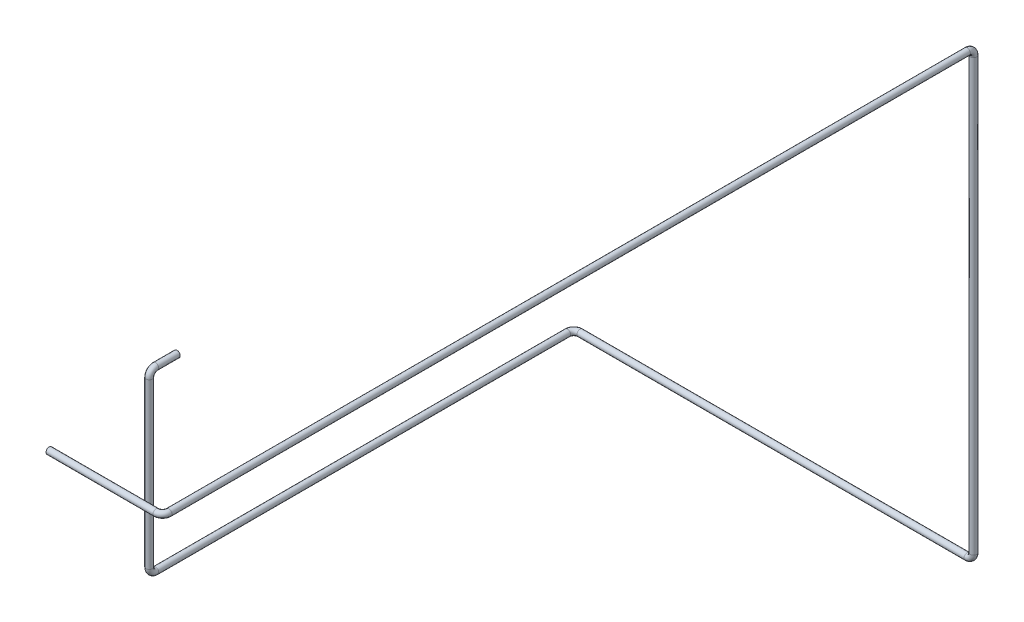
ISO-10303-21;
HEADER;
FILE_DESCRIPTION(('STEP AP214'),'2;1');
FILE_NAME('part.step','',(''),(''),'','','');
FILE_SCHEMA(('AUTOMOTIVE_DESIGN { 1 0 10303 214 1 1 1 1 }'));
ENDSEC;
DATA;
#1=APPLICATION_CONTEXT('core data for automotive mechanical design processes');
#2=APPLICATION_PROTOCOL_DEFINITION('international standard','automotive_design',2000,#1);
#3=PRODUCT_CONTEXT('',#1,'mechanical');
#4=PRODUCT('Part','Part','',(#3));
#5=PRODUCT_RELATED_PRODUCT_CATEGORY('part','',(#4));
#6=PRODUCT_DEFINITION_FORMATION('','',#4);
#7=PRODUCT_DEFINITION_CONTEXT('part definition',#1,'design');
#8=PRODUCT_DEFINITION('design','',#6,#7);
#9=PRODUCT_DEFINITION_SHAPE('','',#8);
#10=(LENGTH_UNIT() NAMED_UNIT(*) SI_UNIT(.MILLI.,.METRE.));
#11=(NAMED_UNIT(*) PLANE_ANGLE_UNIT() SI_UNIT($,.RADIAN.));
#12=(NAMED_UNIT(*) SI_UNIT($,.STERADIAN.) SOLID_ANGLE_UNIT());
#13=UNCERTAINTY_MEASURE_WITH_UNIT(LENGTH_MEASURE(1.E-05),#10,'distance_accuracy_value','');
#14=(GEOMETRIC_REPRESENTATION_CONTEXT(3) GLOBAL_UNCERTAINTY_ASSIGNED_CONTEXT((#13)) GLOBAL_UNIT_ASSIGNED_CONTEXT((#10,
#11,#12)) REPRESENTATION_CONTEXT('',''));
#15=CARTESIAN_POINT('',(0.,0.,0.));
#16=DIRECTION('',(0.,0.,1.));
#17=DIRECTION('',(1.,0.,0.));
#18=AXIS2_PLACEMENT_3D('',#15,#16,#17);
#19=CARTESIAN_POINT('',(-29691.5161722902,-14997.0136339344,42998.3901960568));
#20=DIRECTION('',(1.,0.,0.));
#21=DIRECTION('',(0.,0.,-1.));
#22=AXIS2_PLACEMENT_3D('',#19,#20,#21);
#23=PLANE('',#22);
#24=CARTESIAN_POINT('',(-29691.5161722902,-14997.0136339344,42998.3901960568));
#25=DIRECTION('',(1.,0.,0.));
#26=DIRECTION('',(0.,0.,-1.));
#27=AXIS2_PLACEMENT_3D('',#24,#25,#26);
#28=CIRCLE('',#27,14.0000000000006);
#29=CARTESIAN_POINT('',(-29691.5161722902,-14997.0136339344,42984.3901960568));
#30=VERTEX_POINT('',#29);
#31=EDGE_CURVE('E100',#30,#30,#28,.T.);
#32=ORIENTED_EDGE('',*,*,#31,.T.);
#33=EDGE_LOOP('',(#32));
#34=FACE_BOUND('',#33,.T.);
#35=CARTESIAN_POINT('',(-29691.5161722902,-14997.0136339344,42998.3901960568));
#36=DIRECTION('',(1.,0.,0.));
#37=DIRECTION('',(0.,0.,-1.));
#38=AXIS2_PLACEMENT_3D('',#35,#36,#37);
#39=CIRCLE('',#38,15.0000000000006);
#40=CARTESIAN_POINT('',(-29691.5161722902,-14997.0136339344,42983.3901960568));
#41=VERTEX_POINT('',#40);
#42=EDGE_CURVE('E93',#41,#41,#39,.T.);
#43=ORIENTED_EDGE('',*,*,#42,.F.);
#44=EDGE_LOOP('',(#43));
#45=FACE_BOUND('',#44,.T.);
#46=ADVANCED_FACE('F47',(#34,#45),#23,.F.);
#47=CARTESIAN_POINT('',(-31046.0335157072,-16257.8595062918,41039.2367122807));
#48=DIRECTION('',(0.,0.,-1.));
#49=DIRECTION('',(0.,-1.,0.));
#50=AXIS2_PLACEMENT_3D('',#47,#48,#49);
#51=PLANE('',#50);
#52=CARTESIAN_POINT('',(-31046.0335157072,-16257.8595062918,41039.2367122807));
#53=DIRECTION('',(0.,0.,-1.));
#54=DIRECTION('',(-1.,0.,0.));
#55=AXIS2_PLACEMENT_3D('',#52,#53,#54);
#56=CIRCLE('',#55,14.0000000000006);
#57=CARTESIAN_POINT('',(-31060.0335157072,-16257.8595062918,41039.2367122807));
#58=VERTEX_POINT('',#57);
#59=EDGE_CURVE('E96',#58,#58,#56,.T.);
#60=ORIENTED_EDGE('',*,*,#59,.F.);
#61=EDGE_LOOP('',(#60));
#62=FACE_BOUND('',#61,.T.);
#63=CARTESIAN_POINT('',(-31046.0335157072,-16257.8595062918,41039.2367122807));
#64=DIRECTION('',(0.,0.,-1.));
#65=DIRECTION('',(0.,-1.,0.));
#66=AXIS2_PLACEMENT_3D('',#63,#64,#65);
#67=CIRCLE('',#66,15.0000000000006);
#68=CARTESIAN_POINT('',(-31046.0335157072,-16272.8595062918,41039.2367122807));
#69=VERTEX_POINT('',#68);
#70=EDGE_CURVE('E11',#69,#69,#67,.T.);
#71=ORIENTED_EDGE('',*,*,#70,.T.);
#72=EDGE_LOOP('',(#71));
#73=FACE_BOUND('',#72,.T.);
#74=ADVANCED_FACE('F167',(#62,#73),#51,.T.);
#75=CARTESIAN_POINT('',(-29691.5161722902,-14997.0136339344,42998.3901960568));
#76=DIRECTION('',(1.,0.,0.));
#77=DIRECTION('',(0.,0.,-1.));
#78=AXIS2_PLACEMENT_3D('',#75,#76,#77);
#79=CYLINDRICAL_SURFACE('',#78,15.0000000000006);
#80=CARTESIAN_POINT('',(-29185.3000286654,-14997.0136339344,42998.3901960568));
#81=DIRECTION('',(1.,0.,0.));
#82=DIRECTION('',(0.,0.,-1.));
#83=AXIS2_PLACEMENT_3D('',#80,#81,#82);
#84=CIRCLE('',#83,15.0000000000006);
#85=CARTESIAN_POINT('',(-29185.3000286654,-14997.0136339344,43013.3901960568));
#86=VERTEX_POINT('',#85);
#87=EDGE_CURVE('E90',#86,#86,#84,.T.);
#88=ORIENTED_EDGE('',*,*,#87,.F.);
#89=EDGE_LOOP('',(#88));
#90=FACE_BOUND('',#89,.T.);
#91=ORIENTED_EDGE('',*,*,#42,.T.);
#92=EDGE_LOOP('',(#91));
#93=FACE_BOUND('',#92,.T.);
#94=ADVANCED_FACE('F169',(#90,#93),#79,.T.);
#95=CARTESIAN_POINT('',(-29185.3000286654,-14997.0136339344,42968.3901960568));
#96=DIRECTION('',(0.,1.,0.));
#97=DIRECTION('',(0.,0.,1.));
#98=AXIS2_PLACEMENT_3D('',#95,#96,#97);
#99=TOROIDAL_SURFACE('',#98,30.0000000000011,15.0000000000006);
#100=CARTESIAN_POINT('',(-29155.3000286654,-14997.0136339344,42968.3901960568));
#101=DIRECTION('',(0.,0.,-1.));
#102=DIRECTION('',(-1.,0.,0.));
#103=AXIS2_PLACEMENT_3D('',#100,#101,#102);
#104=CIRCLE('',#103,15.0000000000006);
#105=CARTESIAN_POINT('',(-29140.3000286654,-14997.0136339344,42968.3901960568));
#106=VERTEX_POINT('',#105);
#107=EDGE_CURVE('E87',#106,#106,#104,.T.);
#108=CARTESIAN_POINT('',(-29185.3000286654,-14997.0136339344,42968.3901960568));
#109=DIRECTION('',(0.,1.,0.));
#110=DIRECTION('',(0.,0.,1.));
#111=AXIS2_PLACEMENT_3D('',#108,#109,#110);
#112=CIRCLE('',#111,45.0000000000017);
#113=EDGE_CURVE('',#86,#106,#112,.T.);
#114=ORIENTED_EDGE('',*,*,#87,.T.);
#115=ORIENTED_EDGE('',*,*,#107,.F.);
#116=ORIENTED_EDGE('',*,*,#113,.T.);
#117=ORIENTED_EDGE('',*,*,#113,.F.);
#118=EDGE_LOOP('',(#114,#116,#115,#117));
#119=FACE_BOUND('',#118,.T.);
#120=ADVANCED_FACE('F175',(#119),#99,.T.);
#121=CARTESIAN_POINT('',(-29155.3000286654,-14997.0136339344,42968.3901960568));
#122=DIRECTION('',(0.,0.,-1.));
#123=DIRECTION('',(-1.,0.,0.));
#124=AXIS2_PLACEMENT_3D('',#121,#122,#123);
#125=CYLINDRICAL_SURFACE('',#124,15.0000000000006);
#126=CARTESIAN_POINT('',(-29155.3000286654,-14997.0136339344,39192.6412042976));
#127=DIRECTION('',(0.,0.,-1.));
#128=DIRECTION('',(-1.,0.,0.));
#129=AXIS2_PLACEMENT_3D('',#126,#127,#128);
#130=CIRCLE('',#129,15.0000000000006);
#131=CARTESIAN_POINT('',(-29155.3000286654,-14982.0136339344,39192.6412042976));
#132=VERTEX_POINT('',#131);
#133=EDGE_CURVE('E84',#132,#132,#130,.T.);
#134=ORIENTED_EDGE('',*,*,#133,.F.);
#135=EDGE_LOOP('',(#134));
#136=FACE_BOUND('',#135,.T.);
#137=ORIENTED_EDGE('',*,*,#107,.T.);
#138=EDGE_LOOP('',(#137));
#139=FACE_BOUND('',#138,.T.);
#140=ADVANCED_FACE('F246',(#136,#139),#125,.T.);
#141=CARTESIAN_POINT('',(-29155.3000286654,-15027.0136339344,39192.6412042976));
#142=DIRECTION('',(-1.,0.,0.));
#143=DIRECTION('',(0.,0.,1.));
#144=AXIS2_PLACEMENT_3D('',#141,#142,#143);
#145=TOROIDAL_SURFACE('',#144,29.9999999999994,15.0000000000006);
#146=CARTESIAN_POINT('',(-29155.3000286654,-15027.0136339344,39162.6412042976));
#147=DIRECTION('',(0.,-1.,0.));
#148=DIRECTION('',(-1.,0.,0.));
#149=AXIS2_PLACEMENT_3D('',#146,#147,#148);
#150=CIRCLE('',#149,15.0000000000006);
#151=CARTESIAN_POINT('',(-29155.3000286654,-15027.0136339344,39147.6412042976));
#152=VERTEX_POINT('',#151);
#153=EDGE_CURVE('E81',#152,#152,#150,.T.);
#154=CARTESIAN_POINT('',(-29155.3000286654,-15027.0136339344,39192.6412042976));
#155=DIRECTION('',(-1.,0.,0.));
#156=DIRECTION('',(0.,0.,1.));
#157=AXIS2_PLACEMENT_3D('',#154,#155,#156);
#158=CIRCLE('',#157,44.9999999999999);
#159=EDGE_CURVE('',#132,#152,#158,.T.);
#160=ORIENTED_EDGE('',*,*,#133,.T.);
#161=ORIENTED_EDGE('',*,*,#153,.F.);
#162=ORIENTED_EDGE('',*,*,#159,.T.);
#163=ORIENTED_EDGE('',*,*,#159,.F.);
#164=EDGE_LOOP('',(#160,#162,#161,#163));
#165=FACE_BOUND('',#164,.T.);
#166=ADVANCED_FACE('F250',(#165),#145,.T.);
#167=CARTESIAN_POINT('',(-29155.3000286654,-15027.0136339344,39162.6412042976));
#168=DIRECTION('',(0.,-1.,0.));
#169=DIRECTION('',(0.,0.,-1.));
#170=AXIS2_PLACEMENT_3D('',#167,#168,#169);
#171=CYLINDRICAL_SURFACE('',#170,15.0000000000006);
#172=CARTESIAN_POINT('',(-29155.3000286654,-17064.6660743384,39162.6412042976));
#173=DIRECTION('',(0.,-1.,0.));
#174=DIRECTION('',(-1.,0.,0.));
#175=AXIS2_PLACEMENT_3D('',#172,#173,#174);
#176=CIRCLE('',#175,15.0000000000006);
#177=CARTESIAN_POINT('',(-29140.3000286654,-17064.6660743384,39162.6412042976));
#178=VERTEX_POINT('',#177);
#179=EDGE_CURVE('E78',#178,#178,#176,.T.);
#180=ORIENTED_EDGE('',*,*,#179,.F.);
#181=EDGE_LOOP('',(#180));
#182=FACE_BOUND('',#181,.T.);
#183=ORIENTED_EDGE('',*,*,#153,.T.);
#184=EDGE_LOOP('',(#183));
#185=FACE_BOUND('',#184,.T.);
#186=ADVANCED_FACE('F254',(#182,#185),#171,.T.);
#187=CARTESIAN_POINT('',(-29185.3000286654,-17064.6660743384,39162.6412042976));
#188=DIRECTION('',(0.,0.,-1.));
#189=DIRECTION('',(-1.,0.,0.));
#190=AXIS2_PLACEMENT_3D('',#187,#188,#189);
#191=TOROIDAL_SURFACE('',#190,30.0000000000082,15.0000000000006);
#192=CARTESIAN_POINT('',(-29185.3000286654,-17094.6660743384,39162.6412042976));
#193=DIRECTION('',(-1.,-1.18423789293346E-13,0.));
#194=DIRECTION('',(-1.18423789293346E-13,1.,0.));
#195=AXIS2_PLACEMENT_3D('',#192,#193,#194);
#196=CIRCLE('',#195,15.0000000000006);
#197=CARTESIAN_POINT('',(-29185.3000286654,-17109.6660743384,39162.6412042976));
#198=VERTEX_POINT('',#197);
#199=EDGE_CURVE('E75',#198,#198,#196,.T.);
#200=CARTESIAN_POINT('',(-29185.3000286654,-17064.6660743384,39162.6412042976));
#201=DIRECTION('',(0.,0.,-1.));
#202=DIRECTION('',(-1.,0.,0.));
#203=AXIS2_PLACEMENT_3D('',#200,#201,#202);
#204=CIRCLE('',#203,45.0000000000088);
#205=EDGE_CURVE('',#178,#198,#204,.T.);
#206=ORIENTED_EDGE('',*,*,#179,.T.);
#207=ORIENTED_EDGE('',*,*,#199,.F.);
#208=ORIENTED_EDGE('',*,*,#205,.T.);
#209=ORIENTED_EDGE('',*,*,#205,.F.);
#210=EDGE_LOOP('',(#206,#208,#207,#209));
#211=FACE_BOUND('',#210,.T.);
#212=ADVANCED_FACE('F258',(#211),#191,.T.);
#213=CARTESIAN_POINT('',(-29185.3000286654,-17094.6660743384,39162.6412042976));
#214=DIRECTION('',(-1.,0.,0.));
#215=DIRECTION('',(0.,0.,1.));
#216=AXIS2_PLACEMENT_3D('',#213,#214,#215);
#217=CYLINDRICAL_SURFACE('',#216,15.0000000000006);
#218=CARTESIAN_POINT('',(-31016.0335157072,-17094.6660743384,39162.6412042976));
#219=DIRECTION('',(-1.,0.,0.));
#220=DIRECTION('',(0.,1.,0.));
#221=AXIS2_PLACEMENT_3D('',#218,#219,#220);
#222=CIRCLE('',#221,15.0000000000006);
#223=CARTESIAN_POINT('',(-31016.0335157072,-17094.6660743384,39147.6412042976));
#224=VERTEX_POINT('',#223);
#225=EDGE_CURVE('E72',#224,#224,#222,.T.);
#226=ORIENTED_EDGE('',*,*,#225,.F.);
#227=EDGE_LOOP('',(#226));
#228=FACE_BOUND('',#227,.T.);
#229=ORIENTED_EDGE('',*,*,#199,.T.);
#230=EDGE_LOOP('',(#229));
#231=FACE_BOUND('',#230,.T.);
#232=ADVANCED_FACE('F262',(#228,#231),#217,.T.);
#233=CARTESIAN_POINT('',(-31016.0335157072,-17094.6660743384,39192.6412042976));
#234=DIRECTION('',(0.,1.,0.));
#235=DIRECTION('',(0.,0.,1.));
#236=AXIS2_PLACEMENT_3D('',#233,#234,#235);
#237=TOROIDAL_SURFACE('',#236,30.0000000000011,15.0000000000006);
#238=CARTESIAN_POINT('',(-31046.0335157072,-17094.6660743384,39192.6412042976));
#239=DIRECTION('',(-2.36847578586691E-13,0.,1.));
#240=DIRECTION('',(0.,1.,0.));
#241=AXIS2_PLACEMENT_3D('',#238,#239,#240);
#242=CIRCLE('',#241,15.0000000000006);
#243=CARTESIAN_POINT('',(-31061.0335157072,-17094.6660743384,39192.6412042976));
#244=VERTEX_POINT('',#243);
#245=EDGE_CURVE('E69',#244,#244,#242,.T.);
#246=CARTESIAN_POINT('',(-31016.0335157072,-17094.6660743384,39192.6412042976));
#247=DIRECTION('',(0.,1.,0.));
#248=DIRECTION('',(0.,0.,1.));
#249=AXIS2_PLACEMENT_3D('',#246,#247,#248);
#250=CIRCLE('',#249,45.0000000000017);
#251=EDGE_CURVE('',#224,#244,#250,.T.);
#252=ORIENTED_EDGE('',*,*,#225,.T.);
#253=ORIENTED_EDGE('',*,*,#245,.F.);
#254=ORIENTED_EDGE('',*,*,#251,.T.);
#255=ORIENTED_EDGE('',*,*,#251,.F.);
#256=EDGE_LOOP('',(#252,#254,#253,#255));
#257=FACE_BOUND('',#256,.T.);
#258=ADVANCED_FACE('F266',(#257),#237,.T.);
#259=CARTESIAN_POINT('',(-31046.0335157072,-17094.6660743384,39192.6412042976));
#260=DIRECTION('',(0.,0.,1.));
#261=DIRECTION('',(1.,0.,0.));
#262=AXIS2_PLACEMENT_3D('',#259,#260,#261);
#263=CYLINDRICAL_SURFACE('',#262,15.0000000000006);
#264=CARTESIAN_POINT('',(-31046.0335157072,-17094.6660743384,41140.6368260706));
#265=DIRECTION('',(0.,0.,1.));
#266=DIRECTION('',(0.,1.,0.));
#267=AXIS2_PLACEMENT_3D('',#264,#265,#266);
#268=CIRCLE('',#267,15.0000000000006);
#269=CARTESIAN_POINT('',(-31046.0335157072,-17109.6660743384,41140.6368260707));
#270=VERTEX_POINT('',#269);
#271=EDGE_CURVE('E66',#270,#270,#268,.T.);
#272=ORIENTED_EDGE('',*,*,#271,.F.);
#273=EDGE_LOOP('',(#272));
#274=FACE_BOUND('',#273,.T.);
#275=ORIENTED_EDGE('',*,*,#245,.T.);
#276=EDGE_LOOP('',(#275));
#277=FACE_BOUND('',#276,.T.);
#278=ADVANCED_FACE('F270',(#274,#277),#263,.T.);
#279=CARTESIAN_POINT('',(-31046.0335157072,-17064.6660743384,41140.6368260706));
#280=DIRECTION('',(-1.,0.,0.));
#281=DIRECTION('',(0.,0.,1.));
#282=AXIS2_PLACEMENT_3D('',#279,#280,#281);
#283=TOROIDAL_SURFACE('',#282,30.0000000000011,15.0000000000006);
#284=CARTESIAN_POINT('',(-31046.0335157072,-17064.6660743384,41170.6368260706));
#285=DIRECTION('',(0.,1.,1.18423789293346E-13));
#286=DIRECTION('',(0.,1.18423789293346E-13,-1.));
#287=AXIS2_PLACEMENT_3D('',#284,#285,#286);
#288=CIRCLE('',#287,15.0000000000006);
#289=CARTESIAN_POINT('',(-31046.0335157072,-17064.6660743384,41185.6368260706));
#290=VERTEX_POINT('',#289);
#291=EDGE_CURVE('E61',#290,#290,#288,.T.);
#292=CARTESIAN_POINT('',(-31046.0335157072,-17064.6660743384,41140.6368260706));
#293=DIRECTION('',(-1.,0.,0.));
#294=DIRECTION('',(0.,0.,1.));
#295=AXIS2_PLACEMENT_3D('',#292,#293,#294);
#296=CIRCLE('',#295,45.0000000000017);
#297=EDGE_CURVE('',#270,#290,#296,.T.);
#298=ORIENTED_EDGE('',*,*,#271,.T.);
#299=ORIENTED_EDGE('',*,*,#291,.F.);
#300=ORIENTED_EDGE('',*,*,#297,.T.);
#301=ORIENTED_EDGE('',*,*,#297,.F.);
#302=EDGE_LOOP('',(#298,#300,#299,#301));
#303=FACE_BOUND('',#302,.T.);
#304=ADVANCED_FACE('F274',(#303),#283,.T.);
#305=CARTESIAN_POINT('',(-31046.0335157072,-17064.6660743384,41170.6368260706));
#306=DIRECTION('',(0.,1.,0.));
#307=DIRECTION('',(0.,0.,1.));
#308=AXIS2_PLACEMENT_3D('',#305,#306,#307);
#309=CYLINDRICAL_SURFACE('',#308,15.0000000000006);
#310=CARTESIAN_POINT('',(-31046.0335157072,-16287.8595062918,41170.6368260706));
#311=DIRECTION('',(0.,1.,0.));
#312=DIRECTION('',(0.,0.,-1.));
#313=AXIS2_PLACEMENT_3D('',#310,#311,#312);
#314=CIRCLE('',#313,15.0000000000006);
#315=CARTESIAN_POINT('',(-31046.0335157072,-16287.8595062918,41185.6368260706));
#316=VERTEX_POINT('',#315);
#317=EDGE_CURVE('E57',#316,#316,#314,.T.);
#318=ORIENTED_EDGE('',*,*,#317,.F.);
#319=EDGE_LOOP('',(#318));
#320=FACE_BOUND('',#319,.T.);
#321=ORIENTED_EDGE('',*,*,#291,.T.);
#322=EDGE_LOOP('',(#321));
#323=FACE_BOUND('',#322,.T.);
#324=ADVANCED_FACE('F163',(#320,#323),#309,.T.);
#325=CARTESIAN_POINT('',(-31046.0335157072,-16287.8595062918,41140.6368260706));
#326=DIRECTION('',(-1.,0.,0.));
#327=DIRECTION('',(0.,0.,1.));
#328=AXIS2_PLACEMENT_3D('',#325,#326,#327);
#329=TOROIDAL_SURFACE('',#328,30.0000000000011,15.0000000000006);
#330=CARTESIAN_POINT('',(-31046.0335157072,-16257.8595062918,41140.6368260706));
#331=DIRECTION('',(0.,2.36847578586691E-13,-1.));
#332=DIRECTION('',(0.,-1.,-2.36847578586691E-13));
#333=AXIS2_PLACEMENT_3D('',#330,#331,#332);
#334=CIRCLE('',#333,15.0000000000006);
#335=CARTESIAN_POINT('',(-31046.0335157072,-16242.8595062918,41140.6368260706));
#336=VERTEX_POINT('',#335);
#337=EDGE_CURVE('E53',#336,#336,#334,.T.);
#338=CARTESIAN_POINT('',(-31046.0335157072,-16287.8595062918,41140.6368260706));
#339=DIRECTION('',(-1.,0.,0.));
#340=DIRECTION('',(0.,0.,1.));
#341=AXIS2_PLACEMENT_3D('',#338,#339,#340);
#342=CIRCLE('',#341,45.0000000000017);
#343=EDGE_CURVE('',#316,#336,#342,.T.);
#344=ORIENTED_EDGE('',*,*,#317,.T.);
#345=ORIENTED_EDGE('',*,*,#337,.F.);
#346=ORIENTED_EDGE('',*,*,#343,.T.);
#347=ORIENTED_EDGE('',*,*,#343,.F.);
#348=EDGE_LOOP('',(#344,#346,#345,#347));
#349=FACE_BOUND('',#348,.T.);
#350=ADVANCED_FACE('F157',(#349),#329,.T.);
#351=CARTESIAN_POINT('',(-31046.0335157072,-16257.8595062918,41140.6368260706));
#352=DIRECTION('',(0.,0.,-1.));
#353=DIRECTION('',(-1.,0.,0.));
#354=AXIS2_PLACEMENT_3D('',#351,#352,#353);
#355=CYLINDRICAL_SURFACE('',#354,15.0000000000006);
#356=ORIENTED_EDGE('',*,*,#70,.F.);
#357=EDGE_LOOP('',(#356));
#358=FACE_BOUND('',#357,.T.);
#359=ORIENTED_EDGE('',*,*,#337,.T.);
#360=EDGE_LOOP('',(#359));
#361=FACE_BOUND('',#360,.T.);
#362=ADVANCED_FACE('F154',(#358,#361),#355,.T.);
#363=CARTESIAN_POINT('',(-29691.5161722902,-14997.0136339344,42998.3901960568));
#364=DIRECTION('',(1.,0.,0.));
#365=DIRECTION('',(0.,0.,-1.));
#366=AXIS2_PLACEMENT_3D('',#363,#364,#365);
#367=CYLINDRICAL_SURFACE('',#366,14.0000000000006);
#368=CARTESIAN_POINT('',(-29185.3000286654,-14997.0136339344,42998.3901960568));
#369=DIRECTION('',(-1.,0.,0.));
#370=DIRECTION('',(0.,0.,1.));
#371=AXIS2_PLACEMENT_3D('',#368,#369,#370);
#372=CIRCLE('',#371,14.0000000000006);
#373=CARTESIAN_POINT('',(-29185.3000286654,-14997.0136339344,43012.3901960568));
#374=VERTEX_POINT('',#373);
#375=EDGE_CURVE('E103',#374,#374,#372,.F.);
#376=ORIENTED_EDGE('',*,*,#375,.T.);
#377=EDGE_LOOP('',(#376));
#378=FACE_BOUND('',#377,.T.);
#379=ORIENTED_EDGE('',*,*,#31,.F.);
#380=EDGE_LOOP('',(#379));
#381=FACE_BOUND('',#380,.T.);
#382=ADVANCED_FACE('F139',(#378,#381),#367,.F.);
#383=CARTESIAN_POINT('',(-29185.3000286654,-14997.0136339344,42968.3901960568));
#384=DIRECTION('',(0.,1.,0.));
#385=DIRECTION('',(0.,0.,1.));
#386=AXIS2_PLACEMENT_3D('',#383,#384,#385);
#387=TOROIDAL_SURFACE('',#386,30.0000000000011,14.0000000000006);
#388=CARTESIAN_POINT('',(-29155.3000286654,-14997.0136339344,42968.3901960568));
#389=DIRECTION('',(0.,0.,-1.));
#390=DIRECTION('',(-1.,0.,0.));
#391=AXIS2_PLACEMENT_3D('',#388,#389,#390);
#392=CIRCLE('',#391,14.0000000000006);
#393=CARTESIAN_POINT('',(-29141.3000286654,-14997.0136339344,42968.3901960568));
#394=VERTEX_POINT('',#393);
#395=EDGE_CURVE('E133',#394,#394,#392,.T.);
#396=CARTESIAN_POINT('',(-29185.3000286654,-14997.0136339344,42968.3901960568));
#397=DIRECTION('',(0.,1.,0.));
#398=DIRECTION('',(0.,0.,1.));
#399=AXIS2_PLACEMENT_3D('',#396,#397,#398);
#400=CIRCLE('',#399,44.0000000000017);
#401=EDGE_CURVE('',#374,#394,#400,.T.);
#402=ORIENTED_EDGE('',*,*,#375,.F.);
#403=ORIENTED_EDGE('',*,*,#395,.T.);
#404=ORIENTED_EDGE('',*,*,#401,.T.);
#405=ORIENTED_EDGE('',*,*,#401,.F.);
#406=EDGE_LOOP('',(#402,#404,#403,#405));
#407=FACE_BOUND('',#406,.T.);
#408=ADVANCED_FACE('F142',(#407),#387,.F.);
#409=CARTESIAN_POINT('',(-29155.3000286654,-14997.0136339344,42968.3901960568));
#410=DIRECTION('',(0.,0.,-1.));
#411=DIRECTION('',(-1.,0.,0.));
#412=AXIS2_PLACEMENT_3D('',#409,#410,#411);
#413=CYLINDRICAL_SURFACE('',#412,14.0000000000006);
#414=CARTESIAN_POINT('',(-29155.3000286654,-14997.0136339344,39192.6412042976));
#415=DIRECTION('',(0.,0.,1.));
#416=DIRECTION('',(0.,-1.,0.));
#417=AXIS2_PLACEMENT_3D('',#414,#415,#416);
#418=CIRCLE('',#417,14.0000000000006);
#419=CARTESIAN_POINT('',(-29155.3000286654,-14983.0136339344,39192.6412042976));
#420=VERTEX_POINT('',#419);
#421=EDGE_CURVE('E130',#420,#420,#418,.F.);
#422=ORIENTED_EDGE('',*,*,#421,.T.);
#423=EDGE_LOOP('',(#422));
#424=FACE_BOUND('',#423,.T.);
#425=ORIENTED_EDGE('',*,*,#395,.F.);
#426=EDGE_LOOP('',(#425));
#427=FACE_BOUND('',#426,.T.);
#428=ADVANCED_FACE('F144',(#424,#427),#413,.F.);
#429=CARTESIAN_POINT('',(-29155.3000286654,-15027.0136339344,39192.6412042976));
#430=DIRECTION('',(-1.,0.,0.));
#431=DIRECTION('',(0.,0.,1.));
#432=AXIS2_PLACEMENT_3D('',#429,#430,#431);
#433=TOROIDAL_SURFACE('',#432,29.9999999999994,14.0000000000006);
#434=CARTESIAN_POINT('',(-29155.3000286654,-15027.0136339344,39162.6412042976));
#435=DIRECTION('',(0.,-1.,0.));
#436=DIRECTION('',(0.,0.,-1.));
#437=AXIS2_PLACEMENT_3D('',#434,#435,#436);
#438=CIRCLE('',#437,14.0000000000006);
#439=CARTESIAN_POINT('',(-29155.3000286654,-15027.0136339344,39148.6412042976));
#440=VERTEX_POINT('',#439);
#441=EDGE_CURVE('E127',#440,#440,#438,.T.);
#442=CARTESIAN_POINT('',(-29155.3000286654,-15027.0136339344,39192.6412042976));
#443=DIRECTION('',(-1.,0.,0.));
#444=DIRECTION('',(0.,0.,1.));
#445=AXIS2_PLACEMENT_3D('',#442,#443,#444);
#446=CIRCLE('',#445,43.9999999999999);
#447=EDGE_CURVE('',#420,#440,#446,.T.);
#448=ORIENTED_EDGE('',*,*,#421,.F.);
#449=ORIENTED_EDGE('',*,*,#441,.T.);
#450=ORIENTED_EDGE('',*,*,#447,.T.);
#451=ORIENTED_EDGE('',*,*,#447,.F.);
#452=EDGE_LOOP('',(#448,#450,#449,#451));
#453=FACE_BOUND('',#452,.T.);
#454=ADVANCED_FACE('F151',(#453),#433,.F.);
#455=CARTESIAN_POINT('',(-29155.3000286654,-15027.0136339344,39162.6412042976));
#456=DIRECTION('',(0.,-1.,0.));
#457=DIRECTION('',(0.,0.,-1.));
#458=AXIS2_PLACEMENT_3D('',#455,#456,#457);
#459=CYLINDRICAL_SURFACE('',#458,14.0000000000006);
#460=CARTESIAN_POINT('',(-29155.3000286654,-17064.6660743384,39162.6412042976));
#461=DIRECTION('',(0.,1.,0.));
#462=DIRECTION('',(-1.,0.,0.));
#463=AXIS2_PLACEMENT_3D('',#460,#461,#462);
#464=CIRCLE('',#463,14.0000000000006);
#465=CARTESIAN_POINT('',(-29141.3000286654,-17064.6660743384,39162.6412042976));
#466=VERTEX_POINT('',#465);
#467=EDGE_CURVE('E124',#466,#466,#464,.F.);
#468=ORIENTED_EDGE('',*,*,#467,.T.);
#469=EDGE_LOOP('',(#468));
#470=FACE_BOUND('',#469,.T.);
#471=ORIENTED_EDGE('',*,*,#441,.F.);
#472=EDGE_LOOP('',(#471));
#473=FACE_BOUND('',#472,.T.);
#474=ADVANCED_FACE('F226',(#470,#473),#459,.F.);
#475=CARTESIAN_POINT('',(-29185.3000286654,-17064.6660743384,39162.6412042976));
#476=DIRECTION('',(0.,0.,-1.));
#477=DIRECTION('',(-1.,0.,0.));
#478=AXIS2_PLACEMENT_3D('',#475,#476,#477);
#479=TOROIDAL_SURFACE('',#478,30.0000000000082,14.0000000000006);
#480=CARTESIAN_POINT('',(-29185.3000286654,-17094.6660743384,39162.6412042976));
#481=DIRECTION('',(-1.,0.,0.));
#482=DIRECTION('',(0.,0.,1.));
#483=AXIS2_PLACEMENT_3D('',#480,#481,#482);
#484=CIRCLE('',#483,14.0000000000006);
#485=CARTESIAN_POINT('',(-29185.3000286654,-17108.6660743384,39162.6412042976));
#486=VERTEX_POINT('',#485);
#487=EDGE_CURVE('E121',#486,#486,#484,.T.);
#488=CARTESIAN_POINT('',(-29185.3000286654,-17064.6660743384,39162.6412042976));
#489=DIRECTION('',(0.,0.,-1.));
#490=DIRECTION('',(-1.,0.,0.));
#491=AXIS2_PLACEMENT_3D('',#488,#489,#490);
#492=CIRCLE('',#491,44.0000000000088);
#493=EDGE_CURVE('',#466,#486,#492,.T.);
#494=ORIENTED_EDGE('',*,*,#467,.F.);
#495=ORIENTED_EDGE('',*,*,#487,.T.);
#496=ORIENTED_EDGE('',*,*,#493,.T.);
#497=ORIENTED_EDGE('',*,*,#493,.F.);
#498=EDGE_LOOP('',(#494,#496,#495,#497));
#499=FACE_BOUND('',#498,.T.);
#500=ADVANCED_FACE('F220',(#499),#479,.F.);
#501=CARTESIAN_POINT('',(-29185.3000286654,-17094.6660743384,39162.6412042976));
#502=DIRECTION('',(-1.,0.,0.));
#503=DIRECTION('',(0.,0.,1.));
#504=AXIS2_PLACEMENT_3D('',#501,#502,#503);
#505=CYLINDRICAL_SURFACE('',#504,14.0000000000006);
#506=CARTESIAN_POINT('',(-31016.0335157072,-17094.6660743384,39162.6412042976));
#507=DIRECTION('',(1.,0.,0.));
#508=DIRECTION('',(0.,0.,-1.));
#509=AXIS2_PLACEMENT_3D('',#506,#507,#508);
#510=CIRCLE('',#509,14.0000000000006);
#511=CARTESIAN_POINT('',(-31016.0335157072,-17094.6660743384,39148.6412042976));
#512=VERTEX_POINT('',#511);
#513=EDGE_CURVE('E118',#512,#512,#510,.F.);
#514=ORIENTED_EDGE('',*,*,#513,.T.);
#515=EDGE_LOOP('',(#514));
#516=FACE_BOUND('',#515,.T.);
#517=ORIENTED_EDGE('',*,*,#487,.F.);
#518=EDGE_LOOP('',(#517));
#519=FACE_BOUND('',#518,.T.);
#520=ADVANCED_FACE('F214',(#516,#519),#505,.F.);
#521=CARTESIAN_POINT('',(-31016.0335157072,-17094.6660743384,39192.6412042976));
#522=DIRECTION('',(0.,1.,0.));
#523=DIRECTION('',(0.,0.,1.));
#524=AXIS2_PLACEMENT_3D('',#521,#522,#523);
#525=TOROIDAL_SURFACE('',#524,30.0000000000011,14.0000000000006);
#526=CARTESIAN_POINT('',(-31046.0335157072,-17094.6660743384,39192.6412042976));
#527=DIRECTION('',(0.,0.,1.));
#528=DIRECTION('',(1.,0.,0.));
#529=AXIS2_PLACEMENT_3D('',#526,#527,#528);
#530=CIRCLE('',#529,14.0000000000006);
#531=CARTESIAN_POINT('',(-31060.0335157072,-17094.6660743384,39192.6412042976));
#532=VERTEX_POINT('',#531);
#533=EDGE_CURVE('E115',#532,#532,#530,.T.);
#534=CARTESIAN_POINT('',(-31016.0335157072,-17094.6660743384,39192.6412042976));
#535=DIRECTION('',(0.,1.,0.));
#536=DIRECTION('',(0.,0.,1.));
#537=AXIS2_PLACEMENT_3D('',#534,#535,#536);
#538=CIRCLE('',#537,44.0000000000017);
#539=EDGE_CURVE('',#512,#532,#538,.T.);
#540=ORIENTED_EDGE('',*,*,#513,.F.);
#541=ORIENTED_EDGE('',*,*,#533,.T.);
#542=ORIENTED_EDGE('',*,*,#539,.T.);
#543=ORIENTED_EDGE('',*,*,#539,.F.);
#544=EDGE_LOOP('',(#540,#542,#541,#543));
#545=FACE_BOUND('',#544,.T.);
#546=ADVANCED_FACE('F208',(#545),#525,.F.);
#547=CARTESIAN_POINT('',(-31046.0335157072,-17094.6660743384,39192.6412042976));
#548=DIRECTION('',(0.,0.,1.));
#549=DIRECTION('',(1.,0.,0.));
#550=AXIS2_PLACEMENT_3D('',#547,#548,#549);
#551=CYLINDRICAL_SURFACE('',#550,14.0000000000006);
#552=CARTESIAN_POINT('',(-31046.0335157072,-17094.6660743384,41140.6368260706));
#553=DIRECTION('',(0.,-3.16007820393372E-13,-1.));
#554=DIRECTION('',(0.,1.,-3.16007820393372E-13));
#555=AXIS2_PLACEMENT_3D('',#552,#553,#554);
#556=CIRCLE('',#555,14.0000000000006);
#557=CARTESIAN_POINT('',(-31046.0335157072,-17108.6660743384,41140.6368260706));
#558=VERTEX_POINT('',#557);
#559=EDGE_CURVE('E112',#558,#558,#556,.F.);
#560=ORIENTED_EDGE('',*,*,#559,.T.);
#561=EDGE_LOOP('',(#560));
#562=FACE_BOUND('',#561,.T.);
#563=ORIENTED_EDGE('',*,*,#533,.F.);
#564=EDGE_LOOP('',(#563));
#565=FACE_BOUND('',#564,.T.);
#566=ADVANCED_FACE('F202',(#562,#565),#551,.F.);
#567=CARTESIAN_POINT('',(-31046.0335157072,-17064.6660743384,41140.6368260706));
#568=DIRECTION('',(-1.,0.,0.));
#569=DIRECTION('',(0.,0.,1.));
#570=AXIS2_PLACEMENT_3D('',#567,#568,#569);
#571=TOROIDAL_SURFACE('',#570,30.0000000000011,14.0000000000006);
#572=CARTESIAN_POINT('',(-31046.0335157072,-17064.6660743384,41170.6368260706));
#573=DIRECTION('',(0.,1.,0.));
#574=DIRECTION('',(0.,0.,1.));
#575=AXIS2_PLACEMENT_3D('',#572,#573,#574);
#576=CIRCLE('',#575,14.0000000000006);
#577=CARTESIAN_POINT('',(-31046.0335157072,-17064.6660743384,41184.6368260706));
#578=VERTEX_POINT('',#577);
#579=EDGE_CURVE('E109',#578,#578,#576,.T.);
#580=CARTESIAN_POINT('',(-31046.0335157072,-17064.6660743384,41140.6368260706));
#581=DIRECTION('',(-1.,0.,0.));
#582=DIRECTION('',(0.,0.,1.));
#583=AXIS2_PLACEMENT_3D('',#580,#581,#582);
#584=CIRCLE('',#583,44.0000000000017);
#585=EDGE_CURVE('',#558,#578,#584,.T.);
#586=ORIENTED_EDGE('',*,*,#559,.F.);
#587=ORIENTED_EDGE('',*,*,#579,.T.);
#588=ORIENTED_EDGE('',*,*,#585,.T.);
#589=ORIENTED_EDGE('',*,*,#585,.F.);
#590=EDGE_LOOP('',(#586,#588,#587,#589));
#591=FACE_BOUND('',#590,.T.);
#592=ADVANCED_FACE('F196',(#591),#571,.F.);
#593=CARTESIAN_POINT('',(-31046.0335157072,-17064.6660743384,41170.6368260706));
#594=DIRECTION('',(0.,1.,0.));
#595=DIRECTION('',(0.,0.,1.));
#596=AXIS2_PLACEMENT_3D('',#593,#594,#595);
#597=CYLINDRICAL_SURFACE('',#596,14.0000000000006);
#598=CARTESIAN_POINT('',(-31046.0335157072,-16287.8595062918,41170.6368260706));
#599=DIRECTION('',(0.,-1.,0.));
#600=DIRECTION('',(0.,0.,-1.));
#601=AXIS2_PLACEMENT_3D('',#598,#599,#600);
#602=CIRCLE('',#601,14.0000000000006);
#603=CARTESIAN_POINT('',(-31046.0335157072,-16287.8595062918,41184.6368260706));
#604=VERTEX_POINT('',#603);
#605=EDGE_CURVE('E106',#604,#604,#602,.F.);
#606=ORIENTED_EDGE('',*,*,#605,.T.);
#607=EDGE_LOOP('',(#606));
#608=FACE_BOUND('',#607,.T.);
#609=ORIENTED_EDGE('',*,*,#579,.F.);
#610=EDGE_LOOP('',(#609));
#611=FACE_BOUND('',#610,.T.);
#612=ADVANCED_FACE('F190',(#608,#611),#597,.F.);
#613=CARTESIAN_POINT('',(-31046.0335157072,-16287.8595062918,41140.6368260706));
#614=DIRECTION('',(-1.,0.,0.));
#615=DIRECTION('',(0.,0.,1.));
#616=AXIS2_PLACEMENT_3D('',#613,#614,#615);
#617=TOROIDAL_SURFACE('',#616,30.0000000000011,14.0000000000006);
#618=CARTESIAN_POINT('',(-31046.0335157072,-16257.8595062918,41140.6368260706));
#619=DIRECTION('',(0.,0.,-1.));
#620=DIRECTION('',(-1.,0.,0.));
#621=AXIS2_PLACEMENT_3D('',#618,#619,#620);
#622=CIRCLE('',#621,14.0000000000006);
#623=CARTESIAN_POINT('',(-31046.0335157072,-16243.8595062918,41140.6368260706));
#624=VERTEX_POINT('',#623);
#625=EDGE_CURVE('E99',#624,#624,#622,.T.);
#626=CARTESIAN_POINT('',(-31046.0335157072,-16287.8595062918,41140.6368260706));
#627=DIRECTION('',(-1.,0.,0.));
#628=DIRECTION('',(0.,0.,1.));
#629=AXIS2_PLACEMENT_3D('',#626,#627,#628);
#630=CIRCLE('',#629,44.0000000000017);
#631=EDGE_CURVE('',#604,#624,#630,.T.);
#632=ORIENTED_EDGE('',*,*,#605,.F.);
#633=ORIENTED_EDGE('',*,*,#625,.T.);
#634=ORIENTED_EDGE('',*,*,#631,.T.);
#635=ORIENTED_EDGE('',*,*,#631,.F.);
#636=EDGE_LOOP('',(#632,#634,#633,#635));
#637=FACE_BOUND('',#636,.T.);
#638=ADVANCED_FACE('F184',(#637),#617,.F.);
#639=CARTESIAN_POINT('',(-31046.0335157072,-16257.8595062918,41140.6368260706));
#640=DIRECTION('',(0.,0.,-1.));
#641=DIRECTION('',(-1.,0.,0.));
#642=AXIS2_PLACEMENT_3D('',#639,#640,#641);
#643=CYLINDRICAL_SURFACE('',#642,14.0000000000006);
#644=ORIENTED_EDGE('',*,*,#59,.T.);
#645=EDGE_LOOP('',(#644));
#646=FACE_BOUND('',#645,.T.);
#647=ORIENTED_EDGE('',*,*,#625,.F.);
#648=EDGE_LOOP('',(#647));
#649=FACE_BOUND('',#648,.T.);
#650=ADVANCED_FACE('F179',(#646,#649),#643,.F.);
#651=CLOSED_SHELL('',(#46,#74,#94,#120,#140,#166,#186,#212,#232,#258,#278,#304,#324,#350,#362,
#382,#408,#428,#454,#474,#500,#520,#546,#566,#592,#612,#638,#650));
#652=MANIFOLD_SOLID_BREP('B2',#651);
#653=ADVANCED_BREP_SHAPE_REPRESENTATION('',(#18,#652),#14);
#654=SHAPE_DEFINITION_REPRESENTATION(#9,#653);
ENDSEC;
END-ISO-10303-21;
